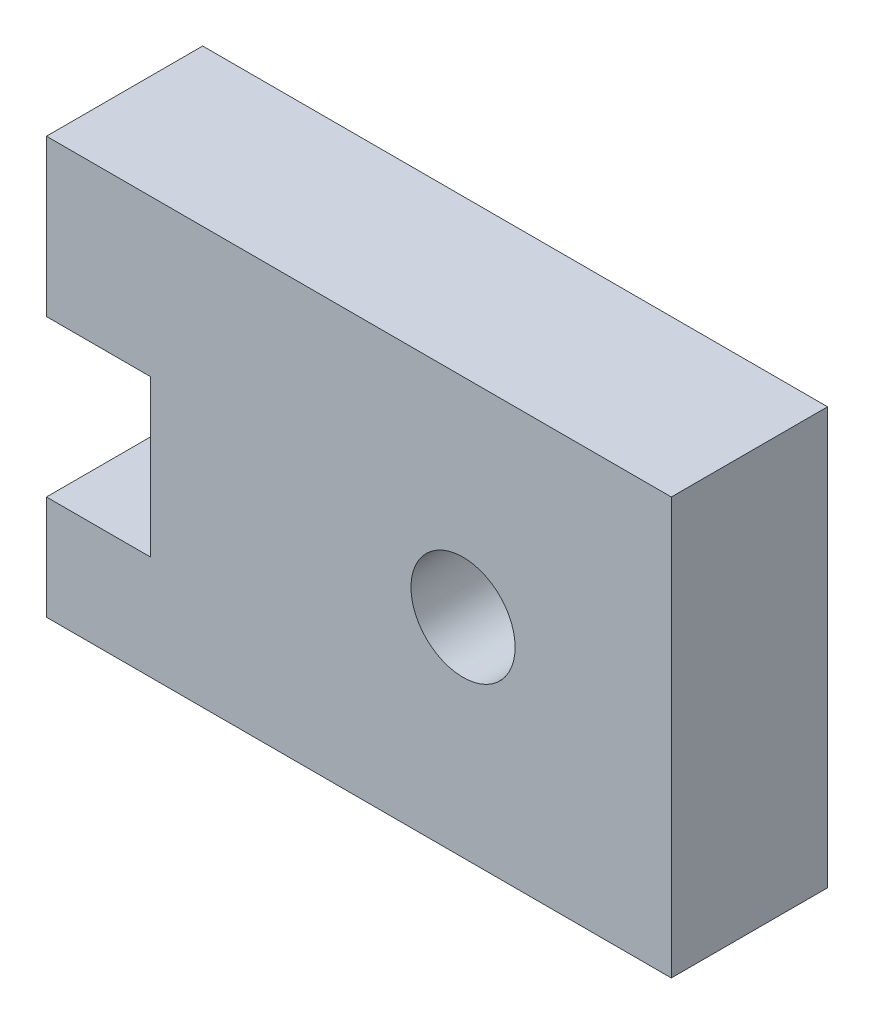
ISO-10303-21;
HEADER;
FILE_DESCRIPTION(('STEP AP214'),'2;1');
FILE_NAME('part.step','',(''),(''),'','','');
FILE_SCHEMA(('AUTOMOTIVE_DESIGN { 1 0 10303 214 1 1 1 1 }'));
ENDSEC;
DATA;
#1=APPLICATION_CONTEXT('core data for automotive mechanical design processes');
#2=APPLICATION_PROTOCOL_DEFINITION('international standard','automotive_design',2000,#1);
#3=PRODUCT_CONTEXT('',#1,'mechanical');
#4=PRODUCT('Part','Part','',(#3));
#5=PRODUCT_RELATED_PRODUCT_CATEGORY('part','',(#4));
#6=PRODUCT_DEFINITION_FORMATION('','',#4);
#7=PRODUCT_DEFINITION_CONTEXT('part definition',#1,'design');
#8=PRODUCT_DEFINITION('design','',#6,#7);
#9=PRODUCT_DEFINITION_SHAPE('','',#8);
#10=(LENGTH_UNIT() NAMED_UNIT(*) SI_UNIT(.MILLI.,.METRE.));
#11=(NAMED_UNIT(*) PLANE_ANGLE_UNIT() SI_UNIT($,.RADIAN.));
#12=(NAMED_UNIT(*) SI_UNIT($,.STERADIAN.) SOLID_ANGLE_UNIT());
#13=UNCERTAINTY_MEASURE_WITH_UNIT(LENGTH_MEASURE(1.E-05),#10,'distance_accuracy_value','');
#14=(GEOMETRIC_REPRESENTATION_CONTEXT(3) GLOBAL_UNCERTAINTY_ASSIGNED_CONTEXT((#13)) GLOBAL_UNIT_ASSIGNED_CONTEXT((#10,
#11,#12)) REPRESENTATION_CONTEXT('',''));
#15=CARTESIAN_POINT('',(0.,0.,0.));
#16=DIRECTION('',(0.,0.,1.));
#17=DIRECTION('',(1.,0.,0.));
#18=AXIS2_PLACEMENT_3D('',#15,#16,#17);
#19=CARTESIAN_POINT('',(0.,7.9375,4.7625));
#20=DIRECTION('',(0.,1.,0.));
#21=DIRECTION('',(0.,0.,1.));
#22=AXIS2_PLACEMENT_3D('',#19,#20,#21);
#23=PLANE('',#22);
#24=DIRECTION('',(1.,0.,0.));
#25=VECTOR('',#24,1.);
#26=CARTESIAN_POINT('',(0.,7.9375,0.));
#27=LINE('',#26,#25);
#28=CARTESIAN_POINT('',(0.,7.9375,0.));
#29=VERTEX_POINT('',#28);
#30=CARTESIAN_POINT('',(3.175,7.9375,0.));
#31=VERTEX_POINT('',#30);
#32=EDGE_CURVE('E148',#29,#31,#27,.T.);
#33=ORIENTED_EDGE('',*,*,#32,.T.);
#34=DIRECTION('',(0.,0.,-1.));
#35=VECTOR('',#34,1.);
#36=CARTESIAN_POINT('',(3.175,7.9375,4.7625));
#37=LINE('',#36,#35);
#38=CARTESIAN_POINT('',(3.175,7.9375,4.7625));
#39=VERTEX_POINT('',#38);
#40=EDGE_CURVE('E11',#39,#31,#37,.T.);
#41=ORIENTED_EDGE('',*,*,#40,.F.);
#42=DIRECTION('',(1.,0.,0.));
#43=VECTOR('',#42,1.);
#44=CARTESIAN_POINT('',(0.,7.9375,4.7625));
#45=LINE('',#44,#43);
#46=CARTESIAN_POINT('',(0.,7.9375,4.7625));
#47=VERTEX_POINT('',#46);
#48=EDGE_CURVE('E203',#47,#39,#45,.T.);
#49=ORIENTED_EDGE('',*,*,#48,.F.);
#50=DIRECTION('',(0.,0.,-1.));
#51=VECTOR('',#50,1.);
#52=CARTESIAN_POINT('',(0.,7.9375,4.7625));
#53=LINE('',#52,#51);
#54=EDGE_CURVE('E57',#47,#29,#53,.T.);
#55=ORIENTED_EDGE('',*,*,#54,.T.);
#56=EDGE_LOOP('',(#33,#41,#49,#55));
#57=FACE_BOUND('',#56,.T.);
#58=ADVANCED_FACE('F39',(#57),#23,.F.);
#59=CARTESIAN_POINT('',(3.175,0.,4.7625));
#60=DIRECTION('',(1.,0.,0.));
#61=DIRECTION('',(0.,0.,-1.));
#62=AXIS2_PLACEMENT_3D('',#59,#60,#61);
#63=PLANE('',#62);
#64=DIRECTION('',(0.,-1.,0.));
#65=VECTOR('',#64,1.);
#66=CARTESIAN_POINT('',(3.175,0.,0.));
#67=LINE('',#66,#65);
#68=CARTESIAN_POINT('',(3.175,3.175,0.));
#69=VERTEX_POINT('',#68);
#70=EDGE_CURVE('E151',#31,#69,#67,.T.);
#71=ORIENTED_EDGE('',*,*,#70,.T.);
#72=DIRECTION('',(0.,0.,-1.));
#73=VECTOR('',#72,1.);
#74=CARTESIAN_POINT('',(3.175,3.175,4.7625));
#75=LINE('',#74,#73);
#76=CARTESIAN_POINT('',(3.175,3.175,4.7625));
#77=VERTEX_POINT('',#76);
#78=EDGE_CURVE('E49',#77,#69,#75,.T.);
#79=ORIENTED_EDGE('',*,*,#78,.F.);
#80=DIRECTION('',(0.,-1.,0.));
#81=VECTOR('',#80,1.);
#82=CARTESIAN_POINT('',(3.175,0.,4.7625));
#83=LINE('',#82,#81);
#84=EDGE_CURVE('E95',#39,#77,#83,.T.);
#85=ORIENTED_EDGE('',*,*,#84,.F.);
#86=ORIENTED_EDGE('',*,*,#40,.T.);
#87=EDGE_LOOP('',(#71,#79,#85,#86));
#88=FACE_BOUND('',#87,.T.);
#89=ADVANCED_FACE('F190',(#88),#63,.F.);
#90=CARTESIAN_POINT('',(0.,3.175,4.7625));
#91=DIRECTION('',(0.,1.,0.));
#92=DIRECTION('',(-1.,0.,0.));
#93=AXIS2_PLACEMENT_3D('',#90,#91,#92);
#94=PLANE('',#93);
#95=DIRECTION('',(1.,0.,0.));
#96=VECTOR('',#95,1.);
#97=CARTESIAN_POINT('',(0.,3.175,0.));
#98=LINE('',#97,#96);
#99=CARTESIAN_POINT('',(0.,3.175,0.));
#100=VERTEX_POINT('',#99);
#101=EDGE_CURVE('E155',#100,#69,#98,.T.);
#102=ORIENTED_EDGE('',*,*,#101,.F.);
#103=DIRECTION('',(0.,0.,-1.));
#104=VECTOR('',#103,1.);
#105=CARTESIAN_POINT('',(0.,3.175,4.7625));
#106=LINE('',#105,#104);
#107=CARTESIAN_POINT('',(0.,3.175,4.7625));
#108=VERTEX_POINT('',#107);
#109=EDGE_CURVE('E181',#108,#100,#106,.T.);
#110=ORIENTED_EDGE('',*,*,#109,.F.);
#111=DIRECTION('',(1.,0.,0.));
#112=VECTOR('',#111,1.);
#113=CARTESIAN_POINT('',(0.,3.175,4.7625));
#114=LINE('',#113,#112);
#115=EDGE_CURVE('E189',#108,#77,#114,.T.);
#116=ORIENTED_EDGE('',*,*,#115,.T.);
#117=ORIENTED_EDGE('',*,*,#78,.T.);
#118=EDGE_LOOP('',(#102,#110,#116,#117));
#119=FACE_BOUND('',#118,.T.);
#120=ADVANCED_FACE('F187',(#119),#94,.T.);
#121=CARTESIAN_POINT('',(0.,0.,4.7625));
#122=DIRECTION('',(-1.,0.,0.));
#123=DIRECTION('',(0.,0.,1.));
#124=AXIS2_PLACEMENT_3D('',#121,#122,#123);
#125=PLANE('',#124);
#126=DIRECTION('',(0.,1.,0.));
#127=VECTOR('',#126,1.);
#128=CARTESIAN_POINT('',(0.,0.,0.));
#129=LINE('',#128,#127);
#130=CARTESIAN_POINT('',(0.,0.,0.));
#131=VERTEX_POINT('',#130);
#132=EDGE_CURVE('E159',#131,#100,#129,.T.);
#133=ORIENTED_EDGE('',*,*,#132,.F.);
#134=DIRECTION('',(0.,0.,-1.));
#135=VECTOR('',#134,1.);
#136=CARTESIAN_POINT('',(0.,0.,4.7625));
#137=LINE('',#136,#135);
#138=CARTESIAN_POINT('',(0.,0.,4.7625));
#139=VERTEX_POINT('',#138);
#140=EDGE_CURVE('E178',#139,#131,#137,.T.);
#141=ORIENTED_EDGE('',*,*,#140,.F.);
#142=DIRECTION('',(0.,1.,0.));
#143=VECTOR('',#142,1.);
#144=CARTESIAN_POINT('',(0.,0.,4.7625));
#145=LINE('',#144,#143);
#146=EDGE_CURVE('E141',#139,#108,#145,.T.);
#147=ORIENTED_EDGE('',*,*,#146,.T.);
#148=ORIENTED_EDGE('',*,*,#109,.T.);
#149=EDGE_LOOP('',(#133,#141,#147,#148));
#150=FACE_BOUND('',#149,.T.);
#151=ADVANCED_FACE('F197',(#150),#125,.T.);
#152=CARTESIAN_POINT('',(0.,0.,4.7625));
#153=DIRECTION('',(0.,1.,0.));
#154=DIRECTION('',(0.,0.,1.));
#155=AXIS2_PLACEMENT_3D('',#152,#153,#154);
#156=PLANE('',#155);
#157=DIRECTION('',(1.,0.,0.));
#158=VECTOR('',#157,1.);
#159=CARTESIAN_POINT('',(0.,0.,0.));
#160=LINE('',#159,#158);
#161=CARTESIAN_POINT('',(19.05,0.,0.));
#162=VERTEX_POINT('',#161);
#163=EDGE_CURVE('E163',#131,#162,#160,.T.);
#164=ORIENTED_EDGE('',*,*,#163,.T.);
#165=DIRECTION('',(0.,0.,-1.));
#166=VECTOR('',#165,1.);
#167=CARTESIAN_POINT('',(19.05,0.,4.7625));
#168=LINE('',#167,#166);
#169=CARTESIAN_POINT('',(19.05,0.,4.7625));
#170=VERTEX_POINT('',#169);
#171=EDGE_CURVE('E133',#170,#162,#168,.T.);
#172=ORIENTED_EDGE('',*,*,#171,.F.);
#173=DIRECTION('',(1.,0.,0.));
#174=VECTOR('',#173,1.);
#175=CARTESIAN_POINT('',(0.,0.,4.7625));
#176=LINE('',#175,#174);
#177=EDGE_CURVE('E119',#139,#170,#176,.T.);
#178=ORIENTED_EDGE('',*,*,#177,.F.);
#179=ORIENTED_EDGE('',*,*,#140,.T.);
#180=EDGE_LOOP('',(#164,#172,#178,#179));
#181=FACE_BOUND('',#180,.T.);
#182=ADVANCED_FACE('F228',(#181),#156,.F.);
#183=CARTESIAN_POINT('',(19.05,0.,4.7625));
#184=DIRECTION('',(-1.,0.,0.));
#185=DIRECTION('',(0.,0.,1.));
#186=AXIS2_PLACEMENT_3D('',#183,#184,#185);
#187=PLANE('',#186);
#188=DIRECTION('',(0.,1.,0.));
#189=VECTOR('',#188,1.);
#190=CARTESIAN_POINT('',(19.05,0.,0.));
#191=LINE('',#190,#189);
#192=CARTESIAN_POINT('',(19.05,12.7,0.));
#193=VERTEX_POINT('',#192);
#194=EDGE_CURVE('E129',#162,#193,#191,.T.);
#195=ORIENTED_EDGE('',*,*,#194,.T.);
#196=DIRECTION('',(0.,0.,-1.));
#197=VECTOR('',#196,1.);
#198=CARTESIAN_POINT('',(19.05,12.7,4.7625));
#199=LINE('',#198,#197);
#200=CARTESIAN_POINT('',(19.05,12.7,4.7625));
#201=VERTEX_POINT('',#200);
#202=EDGE_CURVE('E126',#201,#193,#199,.T.);
#203=ORIENTED_EDGE('',*,*,#202,.F.);
#204=DIRECTION('',(0.,1.,0.));
#205=VECTOR('',#204,1.);
#206=CARTESIAN_POINT('',(19.05,0.,4.7625));
#207=LINE('',#206,#205);
#208=EDGE_CURVE('E111',#170,#201,#207,.T.);
#209=ORIENTED_EDGE('',*,*,#208,.F.);
#210=ORIENTED_EDGE('',*,*,#171,.T.);
#211=EDGE_LOOP('',(#195,#203,#209,#210));
#212=FACE_BOUND('',#211,.T.);
#213=ADVANCED_FACE('F127',(#212),#187,.F.);
#214=CARTESIAN_POINT('',(0.,12.7,4.7625));
#215=DIRECTION('',(0.,1.,0.));
#216=DIRECTION('',(0.,0.,1.));
#217=AXIS2_PLACEMENT_3D('',#214,#215,#216);
#218=PLANE('',#217);
#219=DIRECTION('',(1.,0.,0.));
#220=VECTOR('',#219,1.);
#221=CARTESIAN_POINT('',(0.,12.7,0.));
#222=LINE('',#221,#220);
#223=CARTESIAN_POINT('',(0.,12.7,0.));
#224=VERTEX_POINT('',#223);
#225=EDGE_CURVE('E169',#224,#193,#222,.T.);
#226=ORIENTED_EDGE('',*,*,#225,.F.);
#227=DIRECTION('',(0.,0.,-1.));
#228=VECTOR('',#227,1.);
#229=CARTESIAN_POINT('',(0.,12.7,4.7625));
#230=LINE('',#229,#228);
#231=CARTESIAN_POINT('',(0.,12.7,4.7625));
#232=VERTEX_POINT('',#231);
#233=EDGE_CURVE('E83',#232,#224,#230,.T.);
#234=ORIENTED_EDGE('',*,*,#233,.F.);
#235=DIRECTION('',(1.,0.,0.));
#236=VECTOR('',#235,1.);
#237=CARTESIAN_POINT('',(0.,12.7,4.7625));
#238=LINE('',#237,#236);
#239=EDGE_CURVE('E116',#232,#201,#238,.T.);
#240=ORIENTED_EDGE('',*,*,#239,.T.);
#241=ORIENTED_EDGE('',*,*,#202,.T.);
#242=EDGE_LOOP('',(#226,#234,#240,#241));
#243=FACE_BOUND('',#242,.T.);
#244=ADVANCED_FACE('F135',(#243),#218,.T.);
#245=CARTESIAN_POINT('',(12.7,6.35,4.7625));
#246=DIRECTION('',(0.,0.,-1.));
#247=DIRECTION('',(-1.,0.,0.));
#248=AXIS2_PLACEMENT_3D('',#245,#246,#247);
#249=CYLINDRICAL_SURFACE('',#248,1.5875);
#250=CARTESIAN_POINT('',(12.7,6.35,4.7625));
#251=DIRECTION('',(0.,0.,1.));
#252=DIRECTION('',(1.,0.,0.));
#253=AXIS2_PLACEMENT_3D('',#250,#251,#252);
#254=CIRCLE('',#253,1.5875);
#255=CARTESIAN_POINT('',(14.2875,6.35,4.7625));
#256=VERTEX_POINT('',#255);
#257=EDGE_CURVE('E209',#256,#256,#254,.T.);
#258=ORIENTED_EDGE('',*,*,#257,.T.);
#259=EDGE_LOOP('',(#258));
#260=FACE_BOUND('',#259,.T.);
#261=CARTESIAN_POINT('',(12.7,6.35,0.));
#262=DIRECTION('',(0.,0.,1.));
#263=DIRECTION('',(1.,0.,0.));
#264=AXIS2_PLACEMENT_3D('',#261,#262,#263);
#265=CIRCLE('',#264,1.5875);
#266=CARTESIAN_POINT('',(14.2875,6.35,0.));
#267=VERTEX_POINT('',#266);
#268=EDGE_CURVE('E144',#267,#267,#265,.T.);
#269=ORIENTED_EDGE('',*,*,#268,.F.);
#270=EDGE_LOOP('',(#269));
#271=FACE_BOUND('',#270,.T.);
#272=ADVANCED_FACE('F41',(#260,#271),#249,.F.);
#273=EDGE_CURVE('E164',#29,#224,#129,.T.);
#274=ORIENTED_EDGE('',*,*,#273,.F.);
#275=ORIENTED_EDGE('',*,*,#54,.F.);
#276=EDGE_CURVE('E137',#47,#232,#145,.T.);
#277=ORIENTED_EDGE('',*,*,#276,.T.);
#278=ORIENTED_EDGE('',*,*,#233,.T.);
#279=EDGE_LOOP('',(#274,#275,#277,#278));
#280=FACE_BOUND('',#279,.T.);
#281=ADVANCED_FACE('F216',(#280),#125,.T.);
#282=CARTESIAN_POINT('',(0.,0.,4.7625));
#283=DIRECTION('',(0.,0.,1.));
#284=DIRECTION('',(1.,0.,0.));
#285=AXIS2_PLACEMENT_3D('',#282,#283,#284);
#286=PLANE('',#285);
#287=ORIENTED_EDGE('',*,*,#257,.F.);
#288=EDGE_LOOP('',(#287));
#289=FACE_BOUND('',#288,.T.);
#290=ORIENTED_EDGE('',*,*,#48,.T.);
#291=ORIENTED_EDGE('',*,*,#84,.T.);
#292=ORIENTED_EDGE('',*,*,#115,.F.);
#293=ORIENTED_EDGE('',*,*,#146,.F.);
#294=ORIENTED_EDGE('',*,*,#177,.T.);
#295=ORIENTED_EDGE('',*,*,#208,.T.);
#296=ORIENTED_EDGE('',*,*,#239,.F.);
#297=ORIENTED_EDGE('',*,*,#276,.F.);
#298=EDGE_LOOP('',(#290,#291,#292,#293,#294,#295,#296,#297));
#299=FACE_BOUND('',#298,.T.);
#300=ADVANCED_FACE('F113',(#289,#299),#286,.T.);
#301=CARTESIAN_POINT('',(0.,0.,0.));
#302=DIRECTION('',(0.,0.,1.));
#303=DIRECTION('',(1.,0.,0.));
#304=AXIS2_PLACEMENT_3D('',#301,#302,#303);
#305=PLANE('',#304);
#306=ORIENTED_EDGE('',*,*,#268,.T.);
#307=EDGE_LOOP('',(#306));
#308=FACE_BOUND('',#307,.T.);
#309=ORIENTED_EDGE('',*,*,#32,.F.);
#310=ORIENTED_EDGE('',*,*,#273,.T.);
#311=ORIENTED_EDGE('',*,*,#225,.T.);
#312=ORIENTED_EDGE('',*,*,#194,.F.);
#313=ORIENTED_EDGE('',*,*,#163,.F.);
#314=ORIENTED_EDGE('',*,*,#132,.T.);
#315=ORIENTED_EDGE('',*,*,#101,.T.);
#316=ORIENTED_EDGE('',*,*,#70,.F.);
#317=EDGE_LOOP('',(#309,#310,#311,#312,#313,#314,#315,#316));
#318=FACE_BOUND('',#317,.T.);
#319=ADVANCED_FACE('F193',(#308,#318),#305,.F.);
#320=CLOSED_SHELL('',(#58,#89,#120,#151,#182,#213,#244,#272,#281,#300,#319));
#321=MANIFOLD_SOLID_BREP('B2',#320);
#322=ADVANCED_BREP_SHAPE_REPRESENTATION('',(#18,#321),#14);
#323=SHAPE_DEFINITION_REPRESENTATION(#9,#322);
ENDSEC;
END-ISO-10303-21;
